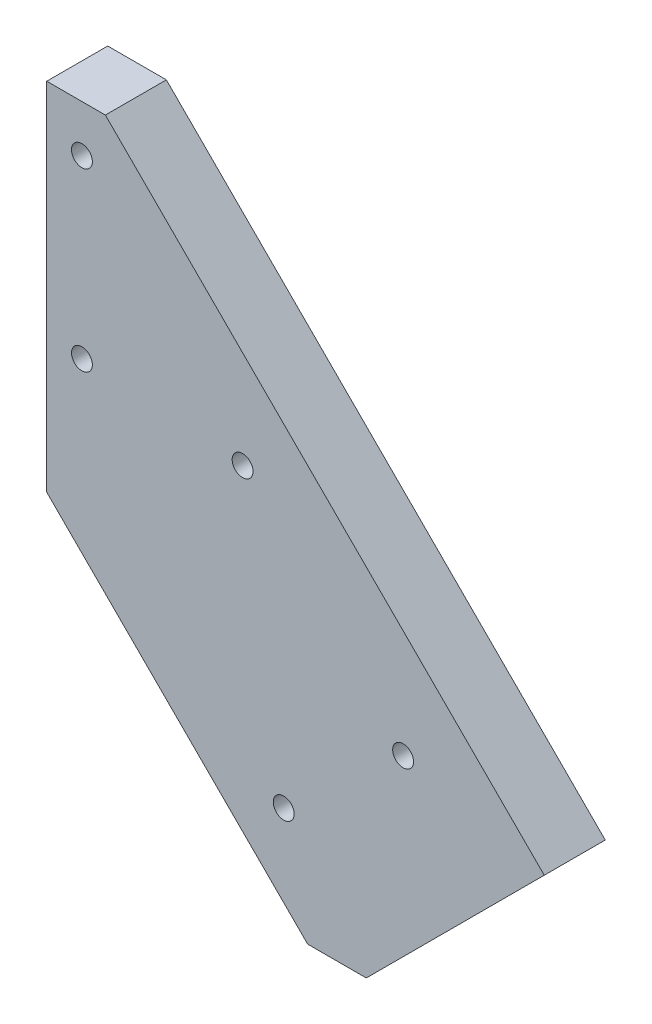
ISO-10303-21;
HEADER;
FILE_DESCRIPTION(('STEP AP214'),'2;1');
FILE_NAME('part.step','',(''),(''),'','','');
FILE_SCHEMA(('AUTOMOTIVE_DESIGN { 1 0 10303 214 1 1 1 1 }'));
ENDSEC;
DATA;
#1=APPLICATION_CONTEXT('core data for automotive mechanical design processes');
#2=APPLICATION_PROTOCOL_DEFINITION('international standard','automotive_design',2000,#1);
#3=PRODUCT_CONTEXT('',#1,'mechanical');
#4=PRODUCT('Part','Part','',(#3));
#5=PRODUCT_RELATED_PRODUCT_CATEGORY('part','',(#4));
#6=PRODUCT_DEFINITION_FORMATION('','',#4);
#7=PRODUCT_DEFINITION_CONTEXT('part definition',#1,'design');
#8=PRODUCT_DEFINITION('design','',#6,#7);
#9=PRODUCT_DEFINITION_SHAPE('','',#8);
#10=(LENGTH_UNIT() NAMED_UNIT(*) SI_UNIT(.MILLI.,.METRE.));
#11=(NAMED_UNIT(*) PLANE_ANGLE_UNIT() SI_UNIT($,.RADIAN.));
#12=(NAMED_UNIT(*) SI_UNIT($,.STERADIAN.) SOLID_ANGLE_UNIT());
#13=UNCERTAINTY_MEASURE_WITH_UNIT(LENGTH_MEASURE(1.E-05),#10,'distance_accuracy_value','');
#14=(GEOMETRIC_REPRESENTATION_CONTEXT(3) GLOBAL_UNCERTAINTY_ASSIGNED_CONTEXT((#13)) GLOBAL_UNIT_ASSIGNED_CONTEXT((#10,
#11,#12)) REPRESENTATION_CONTEXT('',''));
#15=CARTESIAN_POINT('',(0.,0.,0.));
#16=DIRECTION('',(0.,0.,1.));
#17=DIRECTION('',(1.,0.,0.));
#18=AXIS2_PLACEMENT_3D('',#15,#16,#17);
#19=CARTESIAN_POINT('',(53.8815367264148,-53.881536726415,6.604));
#20=DIRECTION('',(-0.707106781186546,0.707106781186549,0.));
#21=DIRECTION('',(-0.707106781186549,-0.707106781186546,0.));
#22=AXIS2_PLACEMENT_3D('',#19,#20,#21);
#23=PLANE('',#22);
#24=DIRECTION('',(0.707106781186549,0.707106781186546,0.));
#25=VECTOR('',#24,1.);
#26=CARTESIAN_POINT('',(53.8815367264148,-53.881536726415,6.604));
#27=LINE('',#26,#25);
#28=CARTESIAN_POINT('',(34.605896423742,-73.1571770290878,6.604));
#29=VERTEX_POINT('',#28);
#30=CARTESIAN_POINT('',(53.8815367264148,-53.881536726415,6.604));
#31=VERTEX_POINT('',#30);
#32=EDGE_CURVE('E88',#29,#31,#27,.T.);
#33=ORIENTED_EDGE('',*,*,#32,.F.);
#34=DIRECTION('',(0.,0.,1.));
#35=VECTOR('',#34,1.);
#36=CARTESIAN_POINT('',(34.605896423742,-73.1571770290878,0.));
#37=LINE('',#36,#35);
#38=CARTESIAN_POINT('',(34.605896423742,-73.1571770290878,0.));
#39=VERTEX_POINT('',#38);
#40=EDGE_CURVE('E99',#39,#29,#37,.T.);
#41=ORIENTED_EDGE('',*,*,#40,.F.);
#42=DIRECTION('',(0.707106781186549,0.707106781186546,0.));
#43=VECTOR('',#42,1.);
#44=CARTESIAN_POINT('',(53.8815367264148,-53.881536726415,0.));
#45=LINE('',#44,#43);
#46=CARTESIAN_POINT('',(53.8815367264148,-53.881536726415,0.));
#47=VERTEX_POINT('',#46);
#48=EDGE_CURVE('E108',#39,#47,#45,.T.);
#49=ORIENTED_EDGE('',*,*,#48,.T.);
#50=DIRECTION('',(0.,0.,-1.));
#51=VECTOR('',#50,1.);
#52=CARTESIAN_POINT('',(53.8815367264148,-53.881536726415,6.604));
#53=LINE('',#52,#51);
#54=EDGE_CURVE('E11',#31,#47,#53,.T.);
#55=ORIENTED_EDGE('',*,*,#54,.F.);
#56=EDGE_LOOP('',(#33,#41,#49,#55));
#57=FACE_BOUND('',#56,.T.);
#58=ADVANCED_FACE('F35',(#57),#23,.F.);
#59=CARTESIAN_POINT('',(6.35,-6.35,6.604));
#60=DIRECTION('',(-0.707106781186549,-0.707106781186546,0.));
#61=DIRECTION('',(0.707106781186546,-0.707106781186549,0.));
#62=AXIS2_PLACEMENT_3D('',#59,#60,#61);
#63=PLANE('',#62);
#64=DIRECTION('',(-0.707106781186546,0.707106781186549,0.));
#65=VECTOR('',#64,1.);
#66=CARTESIAN_POINT('',(6.35,-6.35,0.));
#67=LINE('',#66,#65);
#68=CARTESIAN_POINT('',(6.35,-6.35,0.));
#69=VERTEX_POINT('',#68);
#70=EDGE_CURVE('E114',#47,#69,#67,.T.);
#71=ORIENTED_EDGE('',*,*,#70,.T.);
#72=DIRECTION('',(0.,0.,-1.));
#73=VECTOR('',#72,1.);
#74=CARTESIAN_POINT('',(6.35,-6.35,6.604));
#75=LINE('',#74,#73);
#76=CARTESIAN_POINT('',(6.35,-6.35,6.604));
#77=VERTEX_POINT('',#76);
#78=EDGE_CURVE('E43',#77,#69,#75,.T.);
#79=ORIENTED_EDGE('',*,*,#78,.F.);
#80=DIRECTION('',(-0.707106781186546,0.707106781186549,0.));
#81=VECTOR('',#80,1.);
#82=CARTESIAN_POINT('',(6.35,-6.35,6.604));
#83=LINE('',#82,#81);
#84=EDGE_CURVE('E152',#31,#77,#83,.T.);
#85=ORIENTED_EDGE('',*,*,#84,.F.);
#86=ORIENTED_EDGE('',*,*,#54,.T.);
#87=EDGE_LOOP('',(#71,#79,#85,#86));
#88=FACE_BOUND('',#87,.T.);
#89=ADVANCED_FACE('F198',(#88),#63,.F.);
#90=CARTESIAN_POINT('',(6.35,-6.35,6.604));
#91=DIRECTION('',(0.,-1.,0.));
#92=DIRECTION('',(1.,0.,0.));
#93=AXIS2_PLACEMENT_3D('',#90,#91,#92);
#94=PLANE('',#93);
#95=DIRECTION('',(-1.,0.,0.));
#96=VECTOR('',#95,1.);
#97=CARTESIAN_POINT('',(6.35,-6.35,0.));
#98=LINE('',#97,#96);
#99=CARTESIAN_POINT('',(0.,-6.35,0.));
#100=VERTEX_POINT('',#99);
#101=EDGE_CURVE('E117',#69,#100,#98,.T.);
#102=ORIENTED_EDGE('',*,*,#101,.T.);
#103=DIRECTION('',(0.,0.,-1.));
#104=VECTOR('',#103,1.);
#105=CARTESIAN_POINT('',(0.,-6.35,6.604));
#106=LINE('',#105,#104);
#107=CARTESIAN_POINT('',(0.,-6.35,6.604));
#108=VERTEX_POINT('',#107);
#109=EDGE_CURVE('E132',#108,#100,#106,.T.);
#110=ORIENTED_EDGE('',*,*,#109,.F.);
#111=DIRECTION('',(-1.,0.,0.));
#112=VECTOR('',#111,1.);
#113=CARTESIAN_POINT('',(6.35,-6.35,6.604));
#114=LINE('',#113,#112);
#115=EDGE_CURVE('E154',#77,#108,#114,.T.);
#116=ORIENTED_EDGE('',*,*,#115,.F.);
#117=ORIENTED_EDGE('',*,*,#78,.T.);
#118=EDGE_LOOP('',(#102,#110,#116,#117));
#119=FACE_BOUND('',#118,.T.);
#120=ADVANCED_FACE('F202',(#119),#94,.F.);
#121=CARTESIAN_POINT('',(0.,-44.9012806053458,6.604));
#122=DIRECTION('',(1.,0.,0.));
#123=DIRECTION('',(0.,1.,0.));
#124=AXIS2_PLACEMENT_3D('',#121,#122,#123);
#125=PLANE('',#124);
#126=DIRECTION('',(0.,-1.,0.));
#127=VECTOR('',#126,1.);
#128=CARTESIAN_POINT('',(0.,-44.9012806053458,0.));
#129=LINE('',#128,#127);
#130=CARTESIAN_POINT('',(0.,-44.9012806053458,0.));
#131=VERTEX_POINT('',#130);
#132=EDGE_CURVE('E81',#100,#131,#129,.T.);
#133=ORIENTED_EDGE('',*,*,#132,.T.);
#134=DIRECTION('',(0.,0.,-1.));
#135=VECTOR('',#134,1.);
#136=CARTESIAN_POINT('',(0.,-44.9012806053458,6.604));
#137=LINE('',#136,#135);
#138=CARTESIAN_POINT('',(0.,-44.9012806053458,6.604));
#139=VERTEX_POINT('',#138);
#140=EDGE_CURVE('E130',#139,#131,#137,.T.);
#141=ORIENTED_EDGE('',*,*,#140,.F.);
#142=DIRECTION('',(0.,-1.,0.));
#143=VECTOR('',#142,1.);
#144=CARTESIAN_POINT('',(0.,-44.9012806053458,6.604));
#145=LINE('',#144,#143);
#146=EDGE_CURVE('E60',#108,#139,#145,.T.);
#147=ORIENTED_EDGE('',*,*,#146,.F.);
#148=ORIENTED_EDGE('',*,*,#109,.T.);
#149=EDGE_LOOP('',(#133,#141,#147,#148));
#150=FACE_BOUND('',#149,.T.);
#151=ADVANCED_FACE('F207',(#150),#125,.F.);
#152=CARTESIAN_POINT('',(31.4308964237419,-76.3321770290878,6.604));
#153=DIRECTION('',(0.707106781186549,0.707106781186546,0.));
#154=DIRECTION('',(-0.707106781186546,0.707106781186549,0.));
#155=AXIS2_PLACEMENT_3D('',#152,#153,#154);
#156=PLANE('',#155);
#157=DIRECTION('',(0.707106781186546,-0.707106781186549,0.));
#158=VECTOR('',#157,1.);
#159=CARTESIAN_POINT('',(31.4308964237419,-76.3321770290878,0.));
#160=LINE('',#159,#158);
#161=CARTESIAN_POINT('',(28.2558964237419,-73.1571770290878,0.));
#162=VERTEX_POINT('',#161);
#163=EDGE_CURVE('E128',#131,#162,#160,.T.);
#164=ORIENTED_EDGE('',*,*,#163,.T.);
#165=DIRECTION('',(0.,0.,1.));
#166=VECTOR('',#165,1.);
#167=CARTESIAN_POINT('',(28.255896423742,-73.1571770290878,0.));
#168=LINE('',#167,#166);
#169=CARTESIAN_POINT('',(28.255896423742,-73.1571770290878,6.604));
#170=VERTEX_POINT('',#169);
#171=EDGE_CURVE('E51',#162,#170,#168,.T.);
#172=ORIENTED_EDGE('',*,*,#171,.T.);
#173=DIRECTION('',(0.707106781186546,-0.707106781186549,0.));
#174=VECTOR('',#173,1.);
#175=CARTESIAN_POINT('',(31.4308964237419,-76.3321770290878,6.604));
#176=LINE('',#175,#174);
#177=EDGE_CURVE('E123',#139,#170,#176,.T.);
#178=ORIENTED_EDGE('',*,*,#177,.F.);
#179=ORIENTED_EDGE('',*,*,#140,.T.);
#180=EDGE_LOOP('',(#164,#172,#178,#179));
#181=FACE_BOUND('',#180,.T.);
#182=ADVANCED_FACE('F158',(#181),#156,.F.);
#183=CARTESIAN_POINT('',(0.,0.,6.604));
#184=DIRECTION('',(0.,0.,-1.));
#185=DIRECTION('',(-1.,0.,0.));
#186=AXIS2_PLACEMENT_3D('',#183,#184,#185);
#187=PLANE('',#186);
#188=CARTESIAN_POINT('',(3.81,-11.43,6.604));
#189=DIRECTION('',(0.,0.,1.));
#190=DIRECTION('',(1.,0.,0.));
#191=AXIS2_PLACEMENT_3D('',#188,#189,#190);
#192=CIRCLE('',#191,1.13029999999999);
#193=CARTESIAN_POINT('',(4.94029999999999,-11.43,6.604));
#194=VERTEX_POINT('',#193);
#195=EDGE_CURVE('E159',#194,#194,#192,.T.);
#196=ORIENTED_EDGE('',*,*,#195,.F.);
#197=EDGE_LOOP('',(#196));
#198=FACE_BOUND('',#197,.T.);
#199=CARTESIAN_POINT('',(3.81,-30.48,6.604));
#200=DIRECTION('',(0.,0.,1.));
#201=DIRECTION('',(1.,0.,0.));
#202=AXIS2_PLACEMENT_3D('',#199,#200,#201);
#203=CIRCLE('',#202,1.13029999999999);
#204=CARTESIAN_POINT('',(4.94029999999999,-30.48,6.604));
#205=VERTEX_POINT('',#204);
#206=EDGE_CURVE('E168',#205,#205,#203,.T.);
#207=ORIENTED_EDGE('',*,*,#206,.F.);
#208=EDGE_LOOP('',(#207));
#209=FACE_BOUND('',#208,.T.);
#210=CARTESIAN_POINT('',(25.6632622249749,-61.6896928874106,6.604));
#211=DIRECTION('',(0.,0.,1.));
#212=DIRECTION('',(1.,0.,0.));
#213=AXIS2_PLACEMENT_3D('',#210,#211,#212);
#214=CIRCLE('',#213,1.13029999999999);
#215=CARTESIAN_POINT('',(26.7935622249749,-61.6896928874106,6.604));
#216=VERTEX_POINT('',#215);
#217=EDGE_CURVE('E147',#216,#216,#214,.T.);
#218=ORIENTED_EDGE('',*,*,#217,.F.);
#219=EDGE_LOOP('',(#218));
#220=FACE_BOUND('',#219,.T.);
#221=CARTESIAN_POINT('',(21.2102222219331,-31.7944529916833,6.604));
#222=DIRECTION('',(0.,0.,1.));
#223=DIRECTION('',(1.,0.,0.));
#224=AXIS2_PLACEMENT_3D('',#221,#222,#223);
#225=CIRCLE('',#224,1.13029999999999);
#226=CARTESIAN_POINT('',(22.3405222219331,-31.7944529916833,6.604));
#227=VERTEX_POINT('',#226);
#228=EDGE_CURVE('E137',#227,#227,#225,.T.);
#229=ORIENTED_EDGE('',*,*,#228,.F.);
#230=EDGE_LOOP('',(#229));
#231=FACE_BOUND('',#230,.T.);
#232=CARTESIAN_POINT('',(38.5930176337014,-50.3146696122472,6.604));
#233=DIRECTION('',(0.,0.,1.));
#234=DIRECTION('',(1.,0.,0.));
#235=AXIS2_PLACEMENT_3D('',#232,#233,#234);
#236=CIRCLE('',#235,1.13029999999999);
#237=CARTESIAN_POINT('',(39.7233176337013,-50.3146696122472,6.604));
#238=VERTEX_POINT('',#237);
#239=EDGE_CURVE('E120',#238,#238,#236,.T.);
#240=ORIENTED_EDGE('',*,*,#239,.F.);
#241=EDGE_LOOP('',(#240));
#242=FACE_BOUND('',#241,.T.);
#243=ORIENTED_EDGE('',*,*,#177,.T.);
#244=DIRECTION('',(-1.,0.,0.));
#245=VECTOR('',#244,1.);
#246=CARTESIAN_POINT('',(34.605896423742,-73.1571770290878,6.604));
#247=LINE('',#246,#245);
#248=EDGE_CURVE('E104',#29,#170,#247,.T.);
#249=ORIENTED_EDGE('',*,*,#248,.F.);
#250=ORIENTED_EDGE('',*,*,#32,.T.);
#251=ORIENTED_EDGE('',*,*,#84,.T.);
#252=ORIENTED_EDGE('',*,*,#115,.T.);
#253=ORIENTED_EDGE('',*,*,#146,.T.);
#254=EDGE_LOOP('',(#243,#249,#250,#251,#252,#253));
#255=FACE_BOUND('',#254,.T.);
#256=ADVANCED_FACE('F156',(#198,#209,#220,#231,#242,#255),#187,.F.);
#257=CARTESIAN_POINT('',(0.,0.,0.));
#258=DIRECTION('',(0.,0.,-1.));
#259=DIRECTION('',(-1.,0.,0.));
#260=AXIS2_PLACEMENT_3D('',#257,#258,#259);
#261=PLANE('',#260);
#262=DIRECTION('',(-1.,0.,0.));
#263=VECTOR('',#262,1.);
#264=CARTESIAN_POINT('',(34.605896423742,-73.1571770290878,0.));
#265=LINE('',#264,#263);
#266=EDGE_CURVE('E96',#39,#162,#265,.T.);
#267=ORIENTED_EDGE('',*,*,#266,.T.);
#268=ORIENTED_EDGE('',*,*,#163,.F.);
#269=ORIENTED_EDGE('',*,*,#132,.F.);
#270=ORIENTED_EDGE('',*,*,#101,.F.);
#271=ORIENTED_EDGE('',*,*,#70,.F.);
#272=ORIENTED_EDGE('',*,*,#48,.F.);
#273=EDGE_LOOP('',(#267,#268,#269,#270,#271,#272));
#274=FACE_BOUND('',#273,.T.);
#275=CARTESIAN_POINT('',(3.81,-11.43,0.));
#276=DIRECTION('',(0.,0.,-1.));
#277=DIRECTION('',(-1.,0.,0.));
#278=AXIS2_PLACEMENT_3D('',#275,#276,#277);
#279=CIRCLE('',#278,1.13029999999999);
#280=CARTESIAN_POINT('',(2.67970000000001,-11.43,0.));
#281=VERTEX_POINT('',#280);
#282=EDGE_CURVE('E162',#281,#281,#279,.T.);
#283=ORIENTED_EDGE('',*,*,#282,.F.);
#284=EDGE_LOOP('',(#283));
#285=FACE_BOUND('',#284,.T.);
#286=CARTESIAN_POINT('',(3.81,-30.48,0.));
#287=DIRECTION('',(0.,0.,-1.));
#288=DIRECTION('',(-1.,0.,0.));
#289=AXIS2_PLACEMENT_3D('',#286,#287,#288);
#290=CIRCLE('',#289,1.13029999999999);
#291=CARTESIAN_POINT('',(2.67970000000001,-30.48,0.));
#292=VERTEX_POINT('',#291);
#293=EDGE_CURVE('E170',#292,#292,#290,.T.);
#294=ORIENTED_EDGE('',*,*,#293,.F.);
#295=EDGE_LOOP('',(#294));
#296=FACE_BOUND('',#295,.T.);
#297=CARTESIAN_POINT('',(25.6632622249749,-61.6896928874106,0.));
#298=DIRECTION('',(0.,0.,-1.));
#299=DIRECTION('',(-1.,0.,0.));
#300=AXIS2_PLACEMENT_3D('',#297,#298,#299);
#301=CIRCLE('',#300,1.13029999999999);
#302=CARTESIAN_POINT('',(24.5329622249749,-61.6896928874106,0.));
#303=VERTEX_POINT('',#302);
#304=EDGE_CURVE('E38',#303,#303,#301,.T.);
#305=ORIENTED_EDGE('',*,*,#304,.F.);
#306=EDGE_LOOP('',(#305));
#307=FACE_BOUND('',#306,.T.);
#308=CARTESIAN_POINT('',(21.2102222219331,-31.7944529916833,0.));
#309=DIRECTION('',(0.,0.,-1.));
#310=DIRECTION('',(-1.,0.,0.));
#311=AXIS2_PLACEMENT_3D('',#308,#309,#310);
#312=CIRCLE('',#311,1.13029999999999);
#313=CARTESIAN_POINT('',(20.0799222219331,-31.7944529916833,0.));
#314=VERTEX_POINT('',#313);
#315=EDGE_CURVE('E135',#314,#314,#312,.T.);
#316=ORIENTED_EDGE('',*,*,#315,.F.);
#317=EDGE_LOOP('',(#316));
#318=FACE_BOUND('',#317,.T.);
#319=CARTESIAN_POINT('',(38.5930176337014,-50.3146696122472,0.));
#320=DIRECTION('',(0.,0.,-1.));
#321=DIRECTION('',(-1.,0.,0.));
#322=AXIS2_PLACEMENT_3D('',#319,#320,#321);
#323=CIRCLE('',#322,1.13029999999999);
#324=CARTESIAN_POINT('',(37.4627176337014,-50.3146696122472,0.));
#325=VERTEX_POINT('',#324);
#326=EDGE_CURVE('E115',#325,#325,#323,.T.);
#327=ORIENTED_EDGE('',*,*,#326,.F.);
#328=EDGE_LOOP('',(#327));
#329=FACE_BOUND('',#328,.T.);
#330=ADVANCED_FACE('F111',(#274,#285,#296,#307,#318,#329),#261,.T.);
#331=CARTESIAN_POINT('',(38.5930176337014,-50.3146696122472,6.604));
#332=DIRECTION('',(0.,0.,1.));
#333=DIRECTION('',(1.,0.,0.));
#334=AXIS2_PLACEMENT_3D('',#331,#332,#333);
#335=CYLINDRICAL_SURFACE('',#334,1.13029999999999);
#336=ORIENTED_EDGE('',*,*,#326,.T.);
#337=EDGE_LOOP('',(#336));
#338=FACE_BOUND('',#337,.T.);
#339=ORIENTED_EDGE('',*,*,#239,.T.);
#340=EDGE_LOOP('',(#339));
#341=FACE_BOUND('',#340,.T.);
#342=ADVANCED_FACE('F186',(#338,#341),#335,.F.);
#343=CARTESIAN_POINT('',(21.2102222219331,-31.7944529916833,6.604));
#344=DIRECTION('',(0.,0.,1.));
#345=DIRECTION('',(1.,0.,0.));
#346=AXIS2_PLACEMENT_3D('',#343,#344,#345);
#347=CYLINDRICAL_SURFACE('',#346,1.13029999999999);
#348=ORIENTED_EDGE('',*,*,#315,.T.);
#349=EDGE_LOOP('',(#348));
#350=FACE_BOUND('',#349,.T.);
#351=ORIENTED_EDGE('',*,*,#228,.T.);
#352=EDGE_LOOP('',(#351));
#353=FACE_BOUND('',#352,.T.);
#354=ADVANCED_FACE('F188',(#350,#353),#347,.F.);
#355=CARTESIAN_POINT('',(25.6632622249749,-61.6896928874106,6.604));
#356=DIRECTION('',(0.,0.,1.));
#357=DIRECTION('',(1.,0.,0.));
#358=AXIS2_PLACEMENT_3D('',#355,#356,#357);
#359=CYLINDRICAL_SURFACE('',#358,1.13029999999999);
#360=ORIENTED_EDGE('',*,*,#304,.T.);
#361=EDGE_LOOP('',(#360));
#362=FACE_BOUND('',#361,.T.);
#363=ORIENTED_EDGE('',*,*,#217,.T.);
#364=EDGE_LOOP('',(#363));
#365=FACE_BOUND('',#364,.T.);
#366=ADVANCED_FACE('F177',(#362,#365),#359,.F.);
#367=CARTESIAN_POINT('',(3.81,-30.48,6.604));
#368=DIRECTION('',(0.,0.,1.));
#369=DIRECTION('',(1.,0.,0.));
#370=AXIS2_PLACEMENT_3D('',#367,#368,#369);
#371=CYLINDRICAL_SURFACE('',#370,1.13029999999999);
#372=ORIENTED_EDGE('',*,*,#293,.T.);
#373=EDGE_LOOP('',(#372));
#374=FACE_BOUND('',#373,.T.);
#375=ORIENTED_EDGE('',*,*,#206,.T.);
#376=EDGE_LOOP('',(#375));
#377=FACE_BOUND('',#376,.T.);
#378=ADVANCED_FACE('F245',(#374,#377),#371,.F.);
#379=CARTESIAN_POINT('',(3.81,-11.43,6.604));
#380=DIRECTION('',(0.,0.,1.));
#381=DIRECTION('',(1.,0.,0.));
#382=AXIS2_PLACEMENT_3D('',#379,#380,#381);
#383=CYLINDRICAL_SURFACE('',#382,1.13029999999999);
#384=ORIENTED_EDGE('',*,*,#282,.T.);
#385=EDGE_LOOP('',(#384));
#386=FACE_BOUND('',#385,.T.);
#387=ORIENTED_EDGE('',*,*,#195,.T.);
#388=EDGE_LOOP('',(#387));
#389=FACE_BOUND('',#388,.T.);
#390=ADVANCED_FACE('F235',(#386,#389),#383,.F.);
#391=CARTESIAN_POINT('',(34.605896423742,-73.1571770290878,0.));
#392=DIRECTION('',(0.,1.,0.));
#393=DIRECTION('',(-1.,0.,0.));
#394=AXIS2_PLACEMENT_3D('',#391,#392,#393);
#395=PLANE('',#394);
#396=ORIENTED_EDGE('',*,*,#248,.T.);
#397=ORIENTED_EDGE('',*,*,#171,.F.);
#398=ORIENTED_EDGE('',*,*,#266,.F.);
#399=ORIENTED_EDGE('',*,*,#40,.T.);
#400=EDGE_LOOP('',(#396,#397,#398,#399));
#401=FACE_BOUND('',#400,.T.);
#402=ADVANCED_FACE('F98',(#401),#395,.F.);
#403=CLOSED_SHELL('',(#58,#89,#120,#151,#182,#256,#330,#342,#354,#366,#378,#390,#402));
#404=MANIFOLD_SOLID_BREP('B2',#403);
#405=ADVANCED_BREP_SHAPE_REPRESENTATION('',(#18,#404),#14);
#406=SHAPE_DEFINITION_REPRESENTATION(#9,#405);
ENDSEC;
END-ISO-10303-21;
